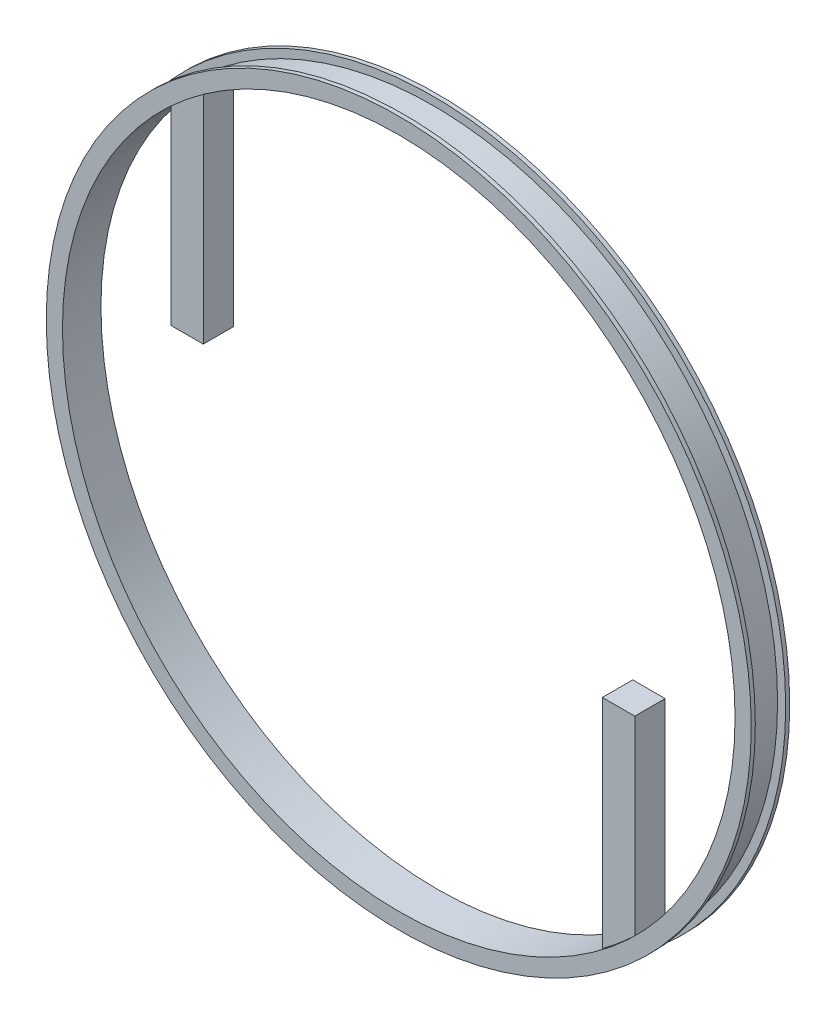
ISO-10303-21;
HEADER;
FILE_DESCRIPTION(('STEP AP214'),'2;1');
FILE_NAME('part.step','',(''),(''),'','','');
FILE_SCHEMA(('AUTOMOTIVE_DESIGN { 1 0 10303 214 1 1 1 1 }'));
ENDSEC;
DATA;
#1=APPLICATION_CONTEXT('core data for automotive mechanical design processes');
#2=APPLICATION_PROTOCOL_DEFINITION('international standard','automotive_design',2000,#1);
#3=PRODUCT_CONTEXT('',#1,'mechanical');
#4=PRODUCT('Part','Part','',(#3));
#5=PRODUCT_RELATED_PRODUCT_CATEGORY('part','',(#4));
#6=PRODUCT_DEFINITION_FORMATION('','',#4);
#7=PRODUCT_DEFINITION_CONTEXT('part definition',#1,'design');
#8=PRODUCT_DEFINITION('design','',#6,#7);
#9=PRODUCT_DEFINITION_SHAPE('','',#8);
#10=(LENGTH_UNIT() NAMED_UNIT(*) SI_UNIT(.MILLI.,.METRE.));
#11=(NAMED_UNIT(*) PLANE_ANGLE_UNIT() SI_UNIT($,.RADIAN.));
#12=(NAMED_UNIT(*) SI_UNIT($,.STERADIAN.) SOLID_ANGLE_UNIT());
#13=UNCERTAINTY_MEASURE_WITH_UNIT(LENGTH_MEASURE(1.E-05),#10,'distance_accuracy_value','');
#14=(GEOMETRIC_REPRESENTATION_CONTEXT(3) GLOBAL_UNCERTAINTY_ASSIGNED_CONTEXT((#13)) GLOBAL_UNIT_ASSIGNED_CONTEXT((#10,
#11,#12)) REPRESENTATION_CONTEXT('',''));
#15=CARTESIAN_POINT('',(0.,0.,0.));
#16=DIRECTION('',(0.,0.,1.));
#17=DIRECTION('',(1.,0.,0.));
#18=AXIS2_PLACEMENT_3D('',#15,#16,#17);
#19=CARTESIAN_POINT('',(0.,0.,-3.75));
#20=DIRECTION('',(0.,0.,1.));
#21=DIRECTION('',(1.,0.,0.));
#22=AXIS2_PLACEMENT_3D('',#19,#20,#21);
#23=PLANE('',#22);
#24=CARTESIAN_POINT('',(0.,0.,-3.75));
#25=DIRECTION('',(0.,0.,1.));
#26=DIRECTION('',(1.,0.,0.));
#27=AXIS2_PLACEMENT_3D('',#24,#25,#26);
#28=CIRCLE('',#27,83.);
#29=CARTESIAN_POINT('',(-49.25,66.8089627220779,-3.75));
#30=VERTEX_POINT('',#29);
#31=CARTESIAN_POINT('',(-57.25,60.0952369160818,-3.75));
#32=VERTEX_POINT('',#31);
#33=EDGE_CURVE('E51',#30,#32,#28,.T.);
#34=ORIENTED_EDGE('',*,*,#33,.F.);
#35=DIRECTION('',(0.,-1.,0.));
#36=VECTOR('',#35,1.);
#37=CARTESIAN_POINT('',(-49.25,13.13,-3.75));
#38=LINE('',#37,#36);
#39=CARTESIAN_POINT('',(-49.25,13.13,-3.75));
#40=VERTEX_POINT('',#39);
#41=EDGE_CURVE('E151',#30,#40,#38,.T.);
#42=ORIENTED_EDGE('',*,*,#41,.T.);
#43=DIRECTION('',(-1.,0.,0.));
#44=VECTOR('',#43,1.);
#45=CARTESIAN_POINT('',(-57.25,13.13,-3.75));
#46=LINE('',#45,#44);
#47=CARTESIAN_POINT('',(-57.25,13.13,-3.75));
#48=VERTEX_POINT('',#47);
#49=EDGE_CURVE('E127',#40,#48,#46,.T.);
#50=ORIENTED_EDGE('',*,*,#49,.T.);
#51=DIRECTION('',(0.,1.,0.));
#52=VECTOR('',#51,1.);
#53=CARTESIAN_POINT('',(-57.25,60.0952369160818,-3.75));
#54=LINE('',#53,#52);
#55=EDGE_CURVE('E156',#48,#32,#54,.T.);
#56=ORIENTED_EDGE('',*,*,#55,.T.);
#57=EDGE_LOOP('',(#34,#42,#50,#56));
#58=FACE_BOUND('',#57,.T.);
#59=ADVANCED_FACE('F39',(#58),#23,.F.);
#60=CARTESIAN_POINT('',(49.25,-66.808962722078,-3.75));
#61=VERTEX_POINT('',#60);
#62=CARTESIAN_POINT('',(57.25,-60.0952369160818,-3.75));
#63=VERTEX_POINT('',#62);
#64=EDGE_CURVE('E11',#61,#63,#28,.T.);
#65=ORIENTED_EDGE('',*,*,#64,.F.);
#66=DIRECTION('',(0.,1.,0.));
#67=VECTOR('',#66,1.);
#68=CARTESIAN_POINT('',(49.25,-13.13,-3.75));
#69=LINE('',#68,#67);
#70=CARTESIAN_POINT('',(49.25,-13.13,-3.75));
#71=VERTEX_POINT('',#70);
#72=EDGE_CURVE('E160',#61,#71,#69,.T.);
#73=ORIENTED_EDGE('',*,*,#72,.T.);
#74=DIRECTION('',(1.,0.,0.));
#75=VECTOR('',#74,1.);
#76=CARTESIAN_POINT('',(57.25,-13.13,-3.75));
#77=LINE('',#76,#75);
#78=CARTESIAN_POINT('',(57.25,-13.13,-3.75));
#79=VERTEX_POINT('',#78);
#80=EDGE_CURVE('E58',#71,#79,#77,.T.);
#81=ORIENTED_EDGE('',*,*,#80,.T.);
#82=DIRECTION('',(0.,-1.,0.));
#83=VECTOR('',#82,1.);
#84=CARTESIAN_POINT('',(57.25,-60.0952369160818,-3.75));
#85=LINE('',#84,#83);
#86=EDGE_CURVE('E147',#79,#63,#85,.T.);
#87=ORIENTED_EDGE('',*,*,#86,.T.);
#88=EDGE_LOOP('',(#65,#73,#81,#87));
#89=FACE_BOUND('',#88,.T.);
#90=ADVANCED_FACE('F241',(#89),#23,.F.);
#91=CARTESIAN_POINT('',(0.,0.,3.75));
#92=DIRECTION('',(0.,0.,1.));
#93=DIRECTION('',(1.,0.,0.));
#94=AXIS2_PLACEMENT_3D('',#91,#92,#93);
#95=PLANE('',#94);
#96=DIRECTION('',(0.,-1.,0.));
#97=VECTOR('',#96,1.);
#98=CARTESIAN_POINT('',(-49.25,13.13,3.75));
#99=LINE('',#98,#97);
#100=CARTESIAN_POINT('',(-49.25,66.8089627220779,3.75));
#101=VERTEX_POINT('',#100);
#102=CARTESIAN_POINT('',(-49.25,13.13,3.75));
#103=VERTEX_POINT('',#102);
#104=EDGE_CURVE('E108',#101,#103,#99,.T.);
#105=ORIENTED_EDGE('',*,*,#104,.F.);
#106=CARTESIAN_POINT('',(0.,0.,3.75));
#107=DIRECTION('',(0.,0.,1.));
#108=DIRECTION('',(1.,0.,0.));
#109=AXIS2_PLACEMENT_3D('',#106,#107,#108);
#110=CIRCLE('',#109,83.);
#111=CARTESIAN_POINT('',(-57.25,60.0952369160818,3.75));
#112=VERTEX_POINT('',#111);
#113=EDGE_CURVE('E188',#101,#112,#110,.T.);
#114=ORIENTED_EDGE('',*,*,#113,.T.);
#115=DIRECTION('',(0.,1.,0.));
#116=VECTOR('',#115,1.);
#117=CARTESIAN_POINT('',(-57.25,60.0952369160818,3.75));
#118=LINE('',#117,#116);
#119=CARTESIAN_POINT('',(-57.25,13.13,3.75));
#120=VERTEX_POINT('',#119);
#121=EDGE_CURVE('E135',#120,#112,#118,.T.);
#122=ORIENTED_EDGE('',*,*,#121,.F.);
#123=DIRECTION('',(-1.,0.,0.));
#124=VECTOR('',#123,1.);
#125=CARTESIAN_POINT('',(-57.25,13.13,3.75));
#126=LINE('',#125,#124);
#127=EDGE_CURVE('E120',#103,#120,#126,.T.);
#128=ORIENTED_EDGE('',*,*,#127,.F.);
#129=EDGE_LOOP('',(#105,#114,#122,#128));
#130=FACE_BOUND('',#129,.T.);
#131=ADVANCED_FACE('F133',(#130),#95,.T.);
#132=DIRECTION('',(0.,1.,0.));
#133=VECTOR('',#132,1.);
#134=CARTESIAN_POINT('',(49.25,-13.13,3.75));
#135=LINE('',#134,#133);
#136=CARTESIAN_POINT('',(49.25,-66.808962722078,3.75));
#137=VERTEX_POINT('',#136);
#138=CARTESIAN_POINT('',(49.25,-13.13,3.75));
#139=VERTEX_POINT('',#138);
#140=EDGE_CURVE('E66',#137,#139,#135,.T.);
#141=ORIENTED_EDGE('',*,*,#140,.F.);
#142=CARTESIAN_POINT('',(57.25,-60.0952369160818,3.75));
#143=VERTEX_POINT('',#142);
#144=EDGE_CURVE('E49',#137,#143,#110,.T.);
#145=ORIENTED_EDGE('',*,*,#144,.T.);
#146=DIRECTION('',(0.,-1.,0.));
#147=VECTOR('',#146,1.);
#148=CARTESIAN_POINT('',(57.25,-60.0952369160818,3.75));
#149=LINE('',#148,#147);
#150=CARTESIAN_POINT('',(57.25,-13.13,3.75));
#151=VERTEX_POINT('',#150);
#152=EDGE_CURVE('E121',#151,#143,#149,.T.);
#153=ORIENTED_EDGE('',*,*,#152,.F.);
#154=DIRECTION('',(1.,0.,0.));
#155=VECTOR('',#154,1.);
#156=CARTESIAN_POINT('',(57.25,-13.13,3.75));
#157=LINE('',#156,#155);
#158=EDGE_CURVE('E98',#139,#151,#157,.T.);
#159=ORIENTED_EDGE('',*,*,#158,.F.);
#160=EDGE_LOOP('',(#141,#145,#153,#159));
#161=FACE_BOUND('',#160,.T.);
#162=ADVANCED_FACE('F250',(#161),#95,.T.);
#163=CARTESIAN_POINT('',(0.,0.,3.75));
#164=DIRECTION('',(0.,0.,-1.));
#165=DIRECTION('',(-1.,0.,0.));
#166=AXIS2_PLACEMENT_3D('',#163,#164,#165);
#167=CYLINDRICAL_SURFACE('',#166,85.);
#168=CARTESIAN_POINT('',(0.,0.,3.75));
#169=DIRECTION('',(0.,0.,1.));
#170=DIRECTION('',(1.,0.,0.));
#171=AXIS2_PLACEMENT_3D('',#168,#169,#170);
#172=CIRCLE('',#171,85.);
#173=CARTESIAN_POINT('',(85.,0.,3.75));
#174=VERTEX_POINT('',#173);
#175=EDGE_CURVE('E180',#174,#174,#172,.T.);
#176=ORIENTED_EDGE('',*,*,#175,.F.);
#177=EDGE_LOOP('',(#176));
#178=FACE_BOUND('',#177,.T.);
#179=CARTESIAN_POINT('',(0.,0.,-3.75));
#180=DIRECTION('',(0.,0.,1.));
#181=DIRECTION('',(1.,0.,0.));
#182=AXIS2_PLACEMENT_3D('',#179,#180,#181);
#183=CIRCLE('',#182,85.);
#184=CARTESIAN_POINT('',(85.,0.,-3.75));
#185=VERTEX_POINT('',#184);
#186=EDGE_CURVE('E43',#185,#185,#183,.T.);
#187=ORIENTED_EDGE('',*,*,#186,.T.);
#188=EDGE_LOOP('',(#187));
#189=FACE_BOUND('',#188,.T.);
#190=ADVANCED_FACE('F41',(#178,#189),#167,.T.);
#191=CARTESIAN_POINT('',(57.25,-13.13,3.75));
#192=DIRECTION('',(0.,1.,0.));
#193=DIRECTION('',(-1.,0.,0.));
#194=AXIS2_PLACEMENT_3D('',#191,#192,#193);
#195=PLANE('',#194);
#196=ORIENTED_EDGE('',*,*,#80,.F.);
#197=DIRECTION('',(0.,0.,-1.));
#198=VECTOR('',#197,1.);
#199=CARTESIAN_POINT('',(49.25,-13.13,3.75));
#200=LINE('',#199,#198);
#201=EDGE_CURVE('E144',#139,#71,#200,.T.);
#202=ORIENTED_EDGE('',*,*,#201,.F.);
#203=ORIENTED_EDGE('',*,*,#158,.T.);
#204=DIRECTION('',(0.,0.,-1.));
#205=VECTOR('',#204,1.);
#206=CARTESIAN_POINT('',(57.25,-13.13,3.75));
#207=LINE('',#206,#205);
#208=EDGE_CURVE('E178',#151,#79,#207,.T.);
#209=ORIENTED_EDGE('',*,*,#208,.T.);
#210=EDGE_LOOP('',(#196,#202,#203,#209));
#211=FACE_BOUND('',#210,.T.);
#212=ADVANCED_FACE('F236',(#211),#195,.T.);
#213=CARTESIAN_POINT('',(57.25,-60.0952369160818,3.75));
#214=DIRECTION('',(1.,0.,0.));
#215=DIRECTION('',(0.,0.,-1.));
#216=AXIS2_PLACEMENT_3D('',#213,#214,#215);
#217=PLANE('',#216);
#218=ORIENTED_EDGE('',*,*,#86,.F.);
#219=ORIENTED_EDGE('',*,*,#208,.F.);
#220=ORIENTED_EDGE('',*,*,#152,.T.);
#221=DIRECTION('',(0.,0.,-1.));
#222=VECTOR('',#221,1.);
#223=CARTESIAN_POINT('',(57.25,-60.0952369160818,3.75));
#224=LINE('',#223,#222);
#225=EDGE_CURVE('E175',#143,#63,#224,.T.);
#226=ORIENTED_EDGE('',*,*,#225,.T.);
#227=EDGE_LOOP('',(#218,#219,#220,#226));
#228=FACE_BOUND('',#227,.T.);
#229=ADVANCED_FACE('F228',(#228),#217,.T.);
#230=CARTESIAN_POINT('',(0.,0.,3.75));
#231=DIRECTION('',(0.,0.,-1.));
#232=DIRECTION('',(-1.,0.,0.));
#233=AXIS2_PLACEMENT_3D('',#230,#231,#232);
#234=CYLINDRICAL_SURFACE('',#233,83.);
#235=DIRECTION('',(0.,0.,-1.));
#236=VECTOR('',#235,1.);
#237=CARTESIAN_POINT('',(49.25,-66.808962722078,3.75));
#238=LINE('',#237,#236);
#239=EDGE_CURVE('E165',#137,#61,#238,.T.);
#240=ORIENTED_EDGE('',*,*,#239,.T.);
#241=ORIENTED_EDGE('',*,*,#64,.T.);
#242=ORIENTED_EDGE('',*,*,#225,.F.);
#243=ORIENTED_EDGE('',*,*,#144,.F.);
#244=EDGE_LOOP('',(#240,#241,#242,#243));
#245=FACE_BOUND('',#244,.T.);
#246=DIRECTION('',(0.,0.,-1.));
#247=VECTOR('',#246,1.);
#248=CARTESIAN_POINT('',(-49.25,66.8089627220779,3.75));
#249=LINE('',#248,#247);
#250=EDGE_CURVE('E115',#101,#30,#249,.T.);
#251=ORIENTED_EDGE('',*,*,#250,.T.);
#252=ORIENTED_EDGE('',*,*,#33,.T.);
#253=DIRECTION('',(0.,0.,-1.));
#254=VECTOR('',#253,1.);
#255=CARTESIAN_POINT('',(-57.25,60.0952369160818,3.75));
#256=LINE('',#255,#254);
#257=EDGE_CURVE('E168',#112,#32,#256,.T.);
#258=ORIENTED_EDGE('',*,*,#257,.F.);
#259=ORIENTED_EDGE('',*,*,#113,.F.);
#260=EDGE_LOOP('',(#251,#252,#258,#259));
#261=FACE_BOUND('',#260,.T.);
#262=CARTESIAN_POINT('',(0.,0.,4.75));
#263=DIRECTION('',(0.,0.,1.));
#264=DIRECTION('',(1.,0.,0.));
#265=AXIS2_PLACEMENT_3D('',#262,#263,#264);
#266=CIRCLE('',#265,83.);
#267=CARTESIAN_POINT('',(83.,0.,4.75));
#268=VERTEX_POINT('',#267);
#269=EDGE_CURVE('E196',#268,#268,#266,.T.);
#270=ORIENTED_EDGE('',*,*,#269,.T.);
#271=EDGE_LOOP('',(#270));
#272=FACE_BOUND('',#271,.T.);
#273=CARTESIAN_POINT('',(0.,0.,-4.75));
#274=DIRECTION('',(0.,0.,1.));
#275=DIRECTION('',(1.,0.,0.));
#276=AXIS2_PLACEMENT_3D('',#273,#274,#275);
#277=CIRCLE('',#276,83.);
#278=CARTESIAN_POINT('',(83.,0.,-4.75));
#279=VERTEX_POINT('',#278);
#280=EDGE_CURVE('E214',#279,#279,#277,.T.);
#281=ORIENTED_EDGE('',*,*,#280,.F.);
#282=EDGE_LOOP('',(#281));
#283=FACE_BOUND('',#282,.T.);
#284=ADVANCED_FACE('F226',(#245,#261,#272,#283),#234,.F.);
#285=CARTESIAN_POINT('',(-49.25,13.13,3.75));
#286=DIRECTION('',(1.,0.,0.));
#287=DIRECTION('',(0.,0.,-1.));
#288=AXIS2_PLACEMENT_3D('',#285,#286,#287);
#289=PLANE('',#288);
#290=ORIENTED_EDGE('',*,*,#41,.F.);
#291=ORIENTED_EDGE('',*,*,#250,.F.);
#292=ORIENTED_EDGE('',*,*,#104,.T.);
#293=DIRECTION('',(0.,0.,-1.));
#294=VECTOR('',#293,1.);
#295=CARTESIAN_POINT('',(-49.25,13.13,3.75));
#296=LINE('',#295,#294);
#297=EDGE_CURVE('E112',#103,#40,#296,.T.);
#298=ORIENTED_EDGE('',*,*,#297,.T.);
#299=EDGE_LOOP('',(#290,#291,#292,#298));
#300=FACE_BOUND('',#299,.T.);
#301=ADVANCED_FACE('F111',(#300),#289,.T.);
#302=CARTESIAN_POINT('',(-57.25,13.13,3.75));
#303=DIRECTION('',(0.,-1.,0.));
#304=DIRECTION('',(0.,0.,-1.));
#305=AXIS2_PLACEMENT_3D('',#302,#303,#304);
#306=PLANE('',#305);
#307=ORIENTED_EDGE('',*,*,#49,.F.);
#308=ORIENTED_EDGE('',*,*,#297,.F.);
#309=ORIENTED_EDGE('',*,*,#127,.T.);
#310=DIRECTION('',(0.,0.,-1.));
#311=VECTOR('',#310,1.);
#312=CARTESIAN_POINT('',(-57.25,13.13,3.75));
#313=LINE('',#312,#311);
#314=EDGE_CURVE('E130',#120,#48,#313,.T.);
#315=ORIENTED_EDGE('',*,*,#314,.T.);
#316=EDGE_LOOP('',(#307,#308,#309,#315));
#317=FACE_BOUND('',#316,.T.);
#318=ADVANCED_FACE('F124',(#317),#306,.T.);
#319=CARTESIAN_POINT('',(-57.25,60.0952369160818,3.75));
#320=DIRECTION('',(-1.,0.,0.));
#321=DIRECTION('',(0.,0.,1.));
#322=AXIS2_PLACEMENT_3D('',#319,#320,#321);
#323=PLANE('',#322);
#324=ORIENTED_EDGE('',*,*,#55,.F.);
#325=ORIENTED_EDGE('',*,*,#314,.F.);
#326=ORIENTED_EDGE('',*,*,#121,.T.);
#327=ORIENTED_EDGE('',*,*,#257,.T.);
#328=EDGE_LOOP('',(#324,#325,#326,#327));
#329=FACE_BOUND('',#328,.T.);
#330=ADVANCED_FACE('F270',(#329),#323,.T.);
#331=CARTESIAN_POINT('',(49.25,-13.13,3.75));
#332=DIRECTION('',(-1.,0.,0.));
#333=DIRECTION('',(0.,-1.,0.));
#334=AXIS2_PLACEMENT_3D('',#331,#332,#333);
#335=PLANE('',#334);
#336=ORIENTED_EDGE('',*,*,#72,.F.);
#337=ORIENTED_EDGE('',*,*,#239,.F.);
#338=ORIENTED_EDGE('',*,*,#140,.T.);
#339=ORIENTED_EDGE('',*,*,#201,.T.);
#340=EDGE_LOOP('',(#336,#337,#338,#339));
#341=FACE_BOUND('',#340,.T.);
#342=ADVANCED_FACE('F272',(#341),#335,.T.);
#343=CARTESIAN_POINT('',(0.,0.,3.75));
#344=DIRECTION('',(0.,0.,1.));
#345=DIRECTION('',(1.,0.,0.));
#346=AXIS2_PLACEMENT_3D('',#343,#344,#345);
#347=PLANE('',#346);
#348=CARTESIAN_POINT('',(0.,0.,3.75));
#349=DIRECTION('',(0.,0.,1.));
#350=DIRECTION('',(1.,0.,0.));
#351=AXIS2_PLACEMENT_3D('',#348,#349,#350);
#352=CIRCLE('',#351,87.);
#353=CARTESIAN_POINT('',(87.,0.,3.75));
#354=VERTEX_POINT('',#353);
#355=EDGE_CURVE('E201',#354,#354,#352,.T.);
#356=ORIENTED_EDGE('',*,*,#355,.F.);
#357=EDGE_LOOP('',(#356));
#358=FACE_BOUND('',#357,.T.);
#359=ORIENTED_EDGE('',*,*,#175,.T.);
#360=EDGE_LOOP('',(#359));
#361=FACE_BOUND('',#360,.T.);
#362=ADVANCED_FACE('F278',(#358,#361),#347,.F.);
#363=CARTESIAN_POINT('',(0.,0.,4.75));
#364=DIRECTION('',(0.,0.,1.));
#365=DIRECTION('',(1.,0.,0.));
#366=AXIS2_PLACEMENT_3D('',#363,#364,#365);
#367=PLANE('',#366);
#368=CARTESIAN_POINT('',(0.,0.,4.75));
#369=DIRECTION('',(0.,0.,1.));
#370=DIRECTION('',(1.,0.,0.));
#371=AXIS2_PLACEMENT_3D('',#368,#369,#370);
#372=CIRCLE('',#371,87.);
#373=CARTESIAN_POINT('',(87.,0.,4.75));
#374=VERTEX_POINT('',#373);
#375=EDGE_CURVE('E148',#374,#374,#372,.T.);
#376=ORIENTED_EDGE('',*,*,#375,.T.);
#377=EDGE_LOOP('',(#376));
#378=FACE_BOUND('',#377,.T.);
#379=ORIENTED_EDGE('',*,*,#269,.F.);
#380=EDGE_LOOP('',(#379));
#381=FACE_BOUND('',#380,.T.);
#382=ADVANCED_FACE('F286',(#378,#381),#367,.T.);
#383=CARTESIAN_POINT('',(0.,0.,4.75));
#384=DIRECTION('',(0.,0.,-1.));
#385=DIRECTION('',(-1.,0.,0.));
#386=AXIS2_PLACEMENT_3D('',#383,#384,#385);
#387=CYLINDRICAL_SURFACE('',#386,87.);
#388=ORIENTED_EDGE('',*,*,#375,.F.);
#389=EDGE_LOOP('',(#388));
#390=FACE_BOUND('',#389,.T.);
#391=ORIENTED_EDGE('',*,*,#355,.T.);
#392=EDGE_LOOP('',(#391));
#393=FACE_BOUND('',#392,.T.);
#394=ADVANCED_FACE('F282',(#390,#393),#387,.T.);
#395=CARTESIAN_POINT('',(0.,0.,-4.75));
#396=DIRECTION('',(0.,0.,1.));
#397=DIRECTION('',(1.,0.,0.));
#398=AXIS2_PLACEMENT_3D('',#395,#396,#397);
#399=CYLINDRICAL_SURFACE('',#398,87.);
#400=CARTESIAN_POINT('',(0.,0.,-4.75));
#401=DIRECTION('',(0.,0.,1.));
#402=DIRECTION('',(1.,0.,0.));
#403=AXIS2_PLACEMENT_3D('',#400,#401,#402);
#404=CIRCLE('',#403,87.);
#405=CARTESIAN_POINT('',(87.,0.,-4.75));
#406=VERTEX_POINT('',#405);
#407=EDGE_CURVE('E203',#406,#406,#404,.T.);
#408=ORIENTED_EDGE('',*,*,#407,.T.);
#409=EDGE_LOOP('',(#408));
#410=FACE_BOUND('',#409,.T.);
#411=CARTESIAN_POINT('',(0.,0.,-3.75));
#412=DIRECTION('',(0.,0.,1.));
#413=DIRECTION('',(1.,0.,0.));
#414=AXIS2_PLACEMENT_3D('',#411,#412,#413);
#415=CIRCLE('',#414,87.);
#416=CARTESIAN_POINT('',(87.,0.,-3.75));
#417=VERTEX_POINT('',#416);
#418=EDGE_CURVE('E208',#417,#417,#415,.T.);
#419=ORIENTED_EDGE('',*,*,#418,.F.);
#420=EDGE_LOOP('',(#419));
#421=FACE_BOUND('',#420,.T.);
#422=ADVANCED_FACE('F285',(#410,#421),#399,.T.);
#423=CARTESIAN_POINT('',(0.,0.,-4.75));
#424=DIRECTION('',(0.,0.,-1.));
#425=DIRECTION('',(1.,0.,0.));
#426=AXIS2_PLACEMENT_3D('',#423,#424,#425);
#427=PLANE('',#426);
#428=ORIENTED_EDGE('',*,*,#280,.T.);
#429=EDGE_LOOP('',(#428));
#430=FACE_BOUND('',#429,.T.);
#431=ORIENTED_EDGE('',*,*,#407,.F.);
#432=EDGE_LOOP('',(#431));
#433=FACE_BOUND('',#432,.T.);
#434=ADVANCED_FACE('F223',(#430,#433),#427,.T.);
#435=CARTESIAN_POINT('',(0.,0.,-3.75));
#436=DIRECTION('',(0.,0.,-1.));
#437=DIRECTION('',(1.,0.,0.));
#438=AXIS2_PLACEMENT_3D('',#435,#436,#437);
#439=PLANE('',#438);
#440=ORIENTED_EDGE('',*,*,#186,.F.);
#441=EDGE_LOOP('',(#440));
#442=FACE_BOUND('',#441,.T.);
#443=ORIENTED_EDGE('',*,*,#418,.T.);
#444=EDGE_LOOP('',(#443));
#445=FACE_BOUND('',#444,.T.);
#446=ADVANCED_FACE('F296',(#442,#445),#439,.F.);
#447=CLOSED_SHELL('',(#59,#90,#131,#162,#190,#212,#229,#284,#301,#318,#330,#342,#362,#382,#394,
#422,#434,#446));
#448=MANIFOLD_SOLID_BREP('B2',#447);
#449=ADVANCED_BREP_SHAPE_REPRESENTATION('',(#18,#448),#14);
#450=SHAPE_DEFINITION_REPRESENTATION(#9,#449);
ENDSEC;
END-ISO-10303-21;
